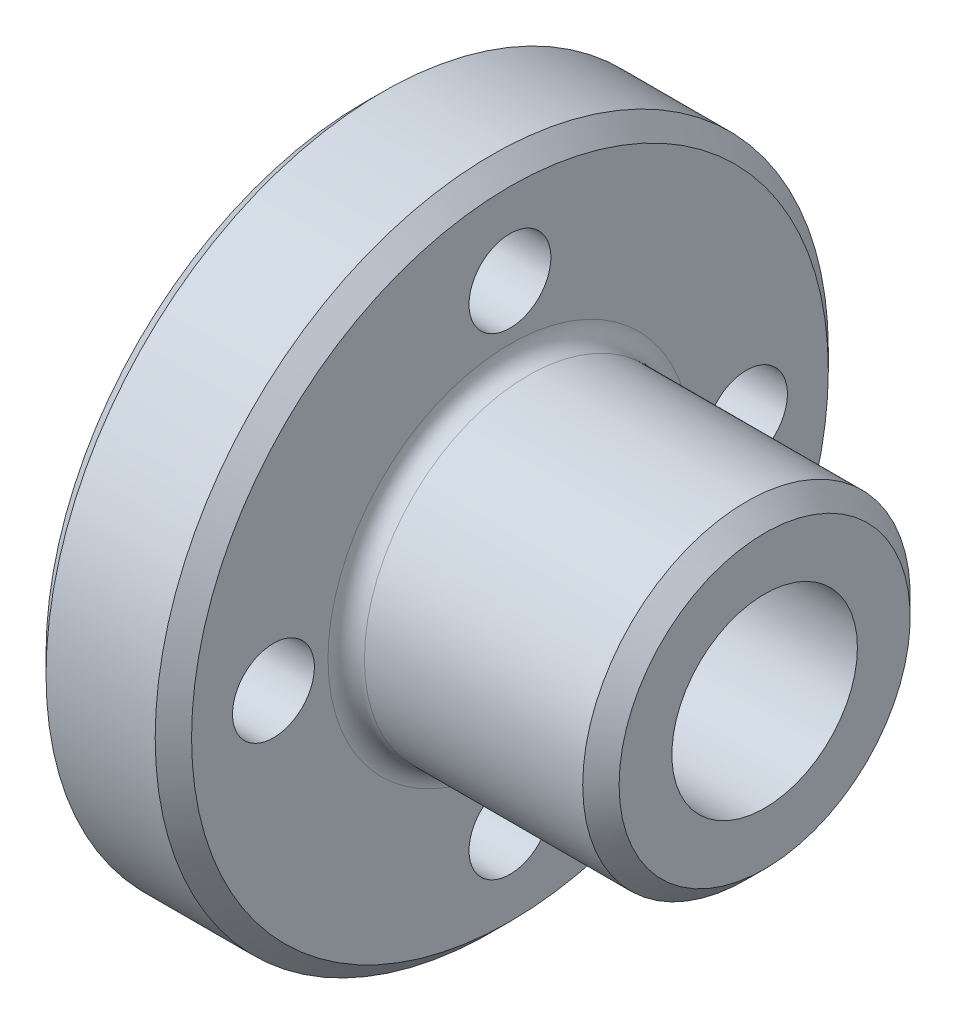
ISO-10303-21;
HEADER;
FILE_DESCRIPTION(('STEP AP214'),'2;1');
FILE_NAME('part.step','',(''),(''),'','','');
FILE_SCHEMA(('AUTOMOTIVE_DESIGN { 1 0 10303 214 1 1 1 1 }'));
ENDSEC;
DATA;
#1=APPLICATION_CONTEXT('core data for automotive mechanical design processes');
#2=APPLICATION_PROTOCOL_DEFINITION('international standard','automotive_design',2000,#1);
#3=PRODUCT_CONTEXT('',#1,'mechanical');
#4=PRODUCT('Part','Part','',(#3));
#5=PRODUCT_RELATED_PRODUCT_CATEGORY('part','',(#4));
#6=PRODUCT_DEFINITION_FORMATION('','',#4);
#7=PRODUCT_DEFINITION_CONTEXT('part definition',#1,'design');
#8=PRODUCT_DEFINITION('design','',#6,#7);
#9=PRODUCT_DEFINITION_SHAPE('','',#8);
#10=(LENGTH_UNIT() NAMED_UNIT(*) SI_UNIT(.MILLI.,.METRE.));
#11=(NAMED_UNIT(*) PLANE_ANGLE_UNIT() SI_UNIT($,.RADIAN.));
#12=(NAMED_UNIT(*) SI_UNIT($,.STERADIAN.) SOLID_ANGLE_UNIT());
#13=UNCERTAINTY_MEASURE_WITH_UNIT(LENGTH_MEASURE(1.E-05),#10,'distance_accuracy_value','');
#14=(GEOMETRIC_REPRESENTATION_CONTEXT(3) GLOBAL_UNCERTAINTY_ASSIGNED_CONTEXT((#13)) GLOBAL_UNIT_ASSIGNED_CONTEXT((#10,
#11,#12)) REPRESENTATION_CONTEXT('',''));
#15=CARTESIAN_POINT('',(0.,0.,0.));
#16=DIRECTION('',(0.,0.,1.));
#17=DIRECTION('',(1.,0.,0.));
#18=AXIS2_PLACEMENT_3D('',#15,#16,#17);
#19=CARTESIAN_POINT('',(0.,0.,0.));
#20=DIRECTION('',(1.,0.,0.));
#21=DIRECTION('',(0.,0.,-1.));
#22=AXIS2_PLACEMENT_3D('',#19,#20,#21);
#23=PLANE('',#22);
#24=CARTESIAN_POINT('',(0.,0.,0.));
#25=DIRECTION('',(1.,0.,0.));
#26=DIRECTION('',(0.,0.,-1.));
#27=AXIS2_PLACEMENT_3D('',#24,#25,#26);
#28=CIRCLE('',#27,6.10000000000001);
#29=CARTESIAN_POINT('',(0.,0.,-6.10000000000001));
#30=VERTEX_POINT('',#29);
#31=EDGE_CURVE('E39',#30,#30,#28,.T.);
#32=ORIENTED_EDGE('',*,*,#31,.T.);
#33=EDGE_LOOP('',(#32));
#34=FACE_BOUND('',#33,.T.);
#35=CARTESIAN_POINT('',(0.,0.,0.));
#36=DIRECTION('',(1.,0.,0.));
#37=DIRECTION('',(0.,0.,-1.));
#38=AXIS2_PLACEMENT_3D('',#35,#36,#37);
#39=CIRCLE('',#38,17.5);
#40=CARTESIAN_POINT('',(0.,0.,-17.5));
#41=VERTEX_POINT('',#40);
#42=EDGE_CURVE('E61',#41,#41,#39,.F.);
#43=ORIENTED_EDGE('',*,*,#42,.T.);
#44=EDGE_LOOP('',(#43));
#45=FACE_BOUND('',#44,.T.);
#46=CARTESIAN_POINT('',(0.,1.36167772214882E-13,13.));
#47=DIRECTION('',(-1.,0.,0.));
#48=DIRECTION('',(0.,0.,1.));
#49=AXIS2_PLACEMENT_3D('',#46,#47,#48);
#50=CIRCLE('',#49,4.);
#51=CARTESIAN_POINT('',(0.,1.36167772214882E-13,17.));
#52=VERTEX_POINT('',#51);
#53=EDGE_CURVE('E115',#52,#52,#50,.T.);
#54=ORIENTED_EDGE('',*,*,#53,.F.);
#55=EDGE_LOOP('',(#54));
#56=FACE_BOUND('',#55,.T.);
#57=CARTESIAN_POINT('',(0.,-13.,0.));
#58=DIRECTION('',(-1.,0.,0.));
#59=DIRECTION('',(0.,0.,1.));
#60=AXIS2_PLACEMENT_3D('',#57,#58,#59);
#61=CIRCLE('',#60,4.);
#62=CARTESIAN_POINT('',(0.,-13.,4.));
#63=VERTEX_POINT('',#62);
#64=EDGE_CURVE('E74',#63,#63,#61,.T.);
#65=ORIENTED_EDGE('',*,*,#64,.F.);
#66=EDGE_LOOP('',(#65));
#67=FACE_BOUND('',#66,.T.);
#68=CARTESIAN_POINT('',(0.,0.,-13.));
#69=DIRECTION('',(-1.,0.,0.));
#70=DIRECTION('',(0.,0.,1.));
#71=AXIS2_PLACEMENT_3D('',#68,#69,#70);
#72=CIRCLE('',#71,4.);
#73=CARTESIAN_POINT('',(0.,0.,-9.));
#74=VERTEX_POINT('',#73);
#75=EDGE_CURVE('E79',#74,#74,#72,.T.);
#76=ORIENTED_EDGE('',*,*,#75,.F.);
#77=EDGE_LOOP('',(#76));
#78=FACE_BOUND('',#77,.T.);
#79=CARTESIAN_POINT('',(0.,13.,0.));
#80=DIRECTION('',(-1.,0.,0.));
#81=DIRECTION('',(0.,0.,1.));
#82=AXIS2_PLACEMENT_3D('',#79,#80,#81);
#83=CIRCLE('',#82,4.);
#84=CARTESIAN_POINT('',(0.,13.,4.));
#85=VERTEX_POINT('',#84);
#86=EDGE_CURVE('E84',#85,#85,#83,.T.);
#87=ORIENTED_EDGE('',*,*,#86,.F.);
#88=EDGE_LOOP('',(#87));
#89=FACE_BOUND('',#88,.T.);
#90=ADVANCED_FACE('F32',(#34,#45,#56,#67,#78,#89),#23,.F.);
#91=CARTESIAN_POINT('',(22.,0.,0.));
#92=DIRECTION('',(-1.,0.,0.));
#93=DIRECTION('',(0.,0.,1.));
#94=AXIS2_PLACEMENT_3D('',#91,#92,#93);
#95=CYLINDRICAL_SURFACE('',#94,18.5);
#96=CARTESIAN_POINT('',(1.,0.,0.));
#97=DIRECTION('',(1.,0.,0.));
#98=DIRECTION('',(0.,0.,-1.));
#99=AXIS2_PLACEMENT_3D('',#96,#97,#98);
#100=CIRCLE('',#99,18.5);
#101=CARTESIAN_POINT('',(1.,0.,-18.5));
#102=VERTEX_POINT('',#101);
#103=EDGE_CURVE('E55',#102,#102,#100,.T.);
#104=ORIENTED_EDGE('',*,*,#103,.T.);
#105=EDGE_LOOP('',(#104));
#106=FACE_BOUND('',#105,.T.);
#107=CARTESIAN_POINT('',(6.99999999999999,0.,0.));
#108=DIRECTION('',(-1.,0.,0.));
#109=DIRECTION('',(0.,0.,1.));
#110=AXIS2_PLACEMENT_3D('',#107,#108,#109);
#111=CIRCLE('',#110,18.5);
#112=CARTESIAN_POINT('',(6.99999999999999,0.,18.5));
#113=VERTEX_POINT('',#112);
#114=EDGE_CURVE('E58',#113,#113,#111,.T.);
#115=ORIENTED_EDGE('',*,*,#114,.T.);
#116=EDGE_LOOP('',(#115));
#117=FACE_BOUND('',#116,.T.);
#118=ADVANCED_FACE('F154',(#106,#117),#95,.T.);
#119=CARTESIAN_POINT('',(8.,18.5,0.));
#120=DIRECTION('',(-1.,0.,0.));
#121=DIRECTION('',(0.,0.,1.));
#122=AXIS2_PLACEMENT_3D('',#119,#120,#121);
#123=PLANE('',#122);
#124=CARTESIAN_POINT('',(8.,0.,0.));
#125=DIRECTION('',(-1.,0.,0.));
#126=DIRECTION('',(0.,0.,1.));
#127=AXIS2_PLACEMENT_3D('',#124,#125,#126);
#128=CIRCLE('',#127,17.5);
#129=CARTESIAN_POINT('',(8.,0.,17.5));
#130=VERTEX_POINT('',#129);
#131=EDGE_CURVE('E52',#130,#130,#128,.F.);
#132=ORIENTED_EDGE('',*,*,#131,.T.);
#133=EDGE_LOOP('',(#132));
#134=FACE_BOUND('',#133,.T.);
#135=CARTESIAN_POINT('',(8.,0.,0.));
#136=DIRECTION('',(-1.,0.,0.));
#137=DIRECTION('',(0.,0.,1.));
#138=AXIS2_PLACEMENT_3D('',#135,#136,#137);
#139=CIRCLE('',#138,10.);
#140=CARTESIAN_POINT('',(8.,0.,10.));
#141=VERTEX_POINT('',#140);
#142=EDGE_CURVE('E67',#141,#141,#139,.T.);
#143=ORIENTED_EDGE('',*,*,#142,.T.);
#144=EDGE_LOOP('',(#143));
#145=FACE_BOUND('',#144,.T.);
#146=CARTESIAN_POINT('',(8.,1.36167772214882E-13,13.));
#147=DIRECTION('',(-1.,0.,0.));
#148=DIRECTION('',(0.,0.,1.));
#149=AXIS2_PLACEMENT_3D('',#146,#147,#148);
#150=CIRCLE('',#149,2.25);
#151=CARTESIAN_POINT('',(8.,1.36167772214882E-13,15.25));
#152=VERTEX_POINT('',#151);
#153=EDGE_CURVE('E71',#152,#152,#150,.T.);
#154=ORIENTED_EDGE('',*,*,#153,.T.);
#155=EDGE_LOOP('',(#154));
#156=FACE_BOUND('',#155,.T.);
#157=CARTESIAN_POINT('',(8.,-13.,0.));
#158=DIRECTION('',(-1.,0.,0.));
#159=DIRECTION('',(0.,0.,1.));
#160=AXIS2_PLACEMENT_3D('',#157,#158,#159);
#161=CIRCLE('',#160,2.25);
#162=CARTESIAN_POINT('',(8.,-13.,2.25));
#163=VERTEX_POINT('',#162);
#164=EDGE_CURVE('E76',#163,#163,#161,.T.);
#165=ORIENTED_EDGE('',*,*,#164,.T.);
#166=EDGE_LOOP('',(#165));
#167=FACE_BOUND('',#166,.T.);
#168=CARTESIAN_POINT('',(8.,0.,-13.));
#169=DIRECTION('',(-1.,0.,0.));
#170=DIRECTION('',(0.,0.,1.));
#171=AXIS2_PLACEMENT_3D('',#168,#169,#170);
#172=CIRCLE('',#171,2.25);
#173=CARTESIAN_POINT('',(8.,0.,-10.75));
#174=VERTEX_POINT('',#173);
#175=EDGE_CURVE('E81',#174,#174,#172,.T.);
#176=ORIENTED_EDGE('',*,*,#175,.T.);
#177=EDGE_LOOP('',(#176));
#178=FACE_BOUND('',#177,.T.);
#179=CARTESIAN_POINT('',(8.,13.,0.));
#180=DIRECTION('',(-1.,0.,0.));
#181=DIRECTION('',(0.,0.,1.));
#182=AXIS2_PLACEMENT_3D('',#179,#180,#181);
#183=CIRCLE('',#182,2.25);
#184=CARTESIAN_POINT('',(8.,13.,2.25));
#185=VERTEX_POINT('',#184);
#186=EDGE_CURVE('E70',#185,#185,#183,.T.);
#187=ORIENTED_EDGE('',*,*,#186,.T.);
#188=EDGE_LOOP('',(#187));
#189=FACE_BOUND('',#188,.T.);
#190=ADVANCED_FACE('F140',(#134,#145,#156,#167,#178,#189),#123,.F.);
#191=CARTESIAN_POINT('',(22.,0.,0.));
#192=DIRECTION('',(-1.,0.,0.));
#193=DIRECTION('',(0.,0.,1.));
#194=AXIS2_PLACEMENT_3D('',#191,#192,#193);
#195=CYLINDRICAL_SURFACE('',#194,9.);
#196=CARTESIAN_POINT('',(21.,0.,0.));
#197=DIRECTION('',(-1.,0.,0.));
#198=DIRECTION('',(0.,0.,1.));
#199=AXIS2_PLACEMENT_3D('',#196,#197,#198);
#200=CIRCLE('',#199,9.);
#201=CARTESIAN_POINT('',(21.,0.,9.));
#202=VERTEX_POINT('',#201);
#203=EDGE_CURVE('E47',#202,#202,#200,.T.);
#204=ORIENTED_EDGE('',*,*,#203,.T.);
#205=EDGE_LOOP('',(#204));
#206=FACE_BOUND('',#205,.T.);
#207=CARTESIAN_POINT('',(9.,0.,0.));
#208=DIRECTION('',(-1.,0.,0.));
#209=DIRECTION('',(0.,0.,1.));
#210=AXIS2_PLACEMENT_3D('',#207,#208,#209);
#211=CIRCLE('',#210,9.);
#212=CARTESIAN_POINT('',(9.,0.,9.));
#213=VERTEX_POINT('',#212);
#214=EDGE_CURVE('E64',#213,#213,#211,.F.);
#215=ORIENTED_EDGE('',*,*,#214,.T.);
#216=EDGE_LOOP('',(#215));
#217=FACE_BOUND('',#216,.T.);
#218=ADVANCED_FACE('F128',(#206,#217),#195,.T.);
#219=CARTESIAN_POINT('',(22.,9.,0.));
#220=DIRECTION('',(-1.,0.,0.));
#221=DIRECTION('',(0.,0.,1.));
#222=AXIS2_PLACEMENT_3D('',#219,#220,#221);
#223=PLANE('',#222);
#224=CARTESIAN_POINT('',(22.,0.,0.));
#225=DIRECTION('',(1.,0.,0.));
#226=DIRECTION('',(0.,0.,-1.));
#227=AXIS2_PLACEMENT_3D('',#224,#225,#226);
#228=CIRCLE('',#227,5.1);
#229=CARTESIAN_POINT('',(22.,0.,-5.1));
#230=VERTEX_POINT('',#229);
#231=EDGE_CURVE('E118',#230,#230,#228,.T.);
#232=ORIENTED_EDGE('',*,*,#231,.F.);
#233=EDGE_LOOP('',(#232));
#234=FACE_BOUND('',#233,.T.);
#235=CARTESIAN_POINT('',(22.,0.,0.));
#236=DIRECTION('',(-1.,0.,0.));
#237=DIRECTION('',(0.,0.,1.));
#238=AXIS2_PLACEMENT_3D('',#235,#236,#237);
#239=CIRCLE('',#238,7.99999999999999);
#240=CARTESIAN_POINT('',(22.,0.,7.99999999999999));
#241=VERTEX_POINT('',#240);
#242=EDGE_CURVE('E43',#241,#241,#239,.F.);
#243=ORIENTED_EDGE('',*,*,#242,.T.);
#244=EDGE_LOOP('',(#243));
#245=FACE_BOUND('',#244,.T.);
#246=ADVANCED_FACE('F124',(#234,#245),#223,.F.);
#247=CARTESIAN_POINT('',(0.,13.,0.));
#248=DIRECTION('',(-1.,0.,0.));
#249=DIRECTION('',(0.,0.,1.));
#250=AXIS2_PLACEMENT_3D('',#247,#248,#249);
#251=CYLINDRICAL_SURFACE('',#250,2.25);
#252=CARTESIAN_POINT('',(2.6,13.,0.));
#253=DIRECTION('',(-1.,0.,0.));
#254=DIRECTION('',(0.,0.,1.));
#255=AXIS2_PLACEMENT_3D('',#252,#253,#254);
#256=CIRCLE('',#255,2.25);
#257=CARTESIAN_POINT('',(2.6,13.,2.25));
#258=VERTEX_POINT('',#257);
#259=EDGE_CURVE('E88',#258,#258,#256,.T.);
#260=ORIENTED_EDGE('',*,*,#259,.T.);
#261=EDGE_LOOP('',(#260));
#262=FACE_BOUND('',#261,.T.);
#263=ORIENTED_EDGE('',*,*,#186,.F.);
#264=EDGE_LOOP('',(#263));
#265=FACE_BOUND('',#264,.T.);
#266=ADVANCED_FACE('F127',(#262,#265),#251,.F.);
#267=CARTESIAN_POINT('',(2.6,15.25,0.));
#268=DIRECTION('',(1.,0.,0.));
#269=DIRECTION('',(0.,0.,-1.));
#270=AXIS2_PLACEMENT_3D('',#267,#268,#269);
#271=PLANE('',#270);
#272=ORIENTED_EDGE('',*,*,#259,.F.);
#273=EDGE_LOOP('',(#272));
#274=FACE_BOUND('',#273,.T.);
#275=CARTESIAN_POINT('',(2.6,13.,0.));
#276=DIRECTION('',(-1.,0.,0.));
#277=DIRECTION('',(0.,0.,1.));
#278=AXIS2_PLACEMENT_3D('',#275,#276,#277);
#279=CIRCLE('',#278,4.);
#280=CARTESIAN_POINT('',(2.6,13.,4.));
#281=VERTEX_POINT('',#280);
#282=EDGE_CURVE('E91',#281,#281,#279,.T.);
#283=ORIENTED_EDGE('',*,*,#282,.T.);
#284=EDGE_LOOP('',(#283));
#285=FACE_BOUND('',#284,.T.);
#286=ADVANCED_FACE('F166',(#274,#285),#271,.F.);
#287=CARTESIAN_POINT('',(0.,13.,0.));
#288=DIRECTION('',(-1.,0.,0.));
#289=DIRECTION('',(0.,0.,1.));
#290=AXIS2_PLACEMENT_3D('',#287,#288,#289);
#291=CYLINDRICAL_SURFACE('',#290,4.);
#292=ORIENTED_EDGE('',*,*,#282,.F.);
#293=EDGE_LOOP('',(#292));
#294=FACE_BOUND('',#293,.T.);
#295=ORIENTED_EDGE('',*,*,#86,.T.);
#296=EDGE_LOOP('',(#295));
#297=FACE_BOUND('',#296,.T.);
#298=ADVANCED_FACE('F172',(#294,#297),#291,.F.);
#299=CARTESIAN_POINT('',(0.,0.,-13.));
#300=DIRECTION('',(-1.,0.,0.));
#301=DIRECTION('',(0.,0.,1.));
#302=AXIS2_PLACEMENT_3D('',#299,#300,#301);
#303=CYLINDRICAL_SURFACE('',#302,2.25);
#304=CARTESIAN_POINT('',(2.6,0.,-13.));
#305=DIRECTION('',(-1.,0.,0.));
#306=DIRECTION('',(0.,0.,1.));
#307=AXIS2_PLACEMENT_3D('',#304,#305,#306);
#308=CIRCLE('',#307,2.25);
#309=CARTESIAN_POINT('',(2.6,0.,-10.75));
#310=VERTEX_POINT('',#309);
#311=EDGE_CURVE('E85',#310,#310,#308,.T.);
#312=ORIENTED_EDGE('',*,*,#311,.T.);
#313=EDGE_LOOP('',(#312));
#314=FACE_BOUND('',#313,.T.);
#315=ORIENTED_EDGE('',*,*,#175,.F.);
#316=EDGE_LOOP('',(#315));
#317=FACE_BOUND('',#316,.T.);
#318=ADVANCED_FACE('F328',(#314,#317),#303,.F.);
#319=CARTESIAN_POINT('',(2.6,2.24999999999996,-13.));
#320=DIRECTION('',(1.,0.,0.));
#321=DIRECTION('',(0.,0.,-1.));
#322=AXIS2_PLACEMENT_3D('',#319,#320,#321);
#323=PLANE('',#322);
#324=ORIENTED_EDGE('',*,*,#311,.F.);
#325=EDGE_LOOP('',(#324));
#326=FACE_BOUND('',#325,.T.);
#327=CARTESIAN_POINT('',(2.6,0.,-13.));
#328=DIRECTION('',(-1.,0.,0.));
#329=DIRECTION('',(0.,0.,1.));
#330=AXIS2_PLACEMENT_3D('',#327,#328,#329);
#331=CIRCLE('',#330,4.);
#332=CARTESIAN_POINT('',(2.6,0.,-9.));
#333=VERTEX_POINT('',#332);
#334=EDGE_CURVE('E98',#333,#333,#331,.T.);
#335=ORIENTED_EDGE('',*,*,#334,.T.);
#336=EDGE_LOOP('',(#335));
#337=FACE_BOUND('',#336,.T.);
#338=ADVANCED_FACE('F318',(#326,#337),#323,.F.);
#339=CARTESIAN_POINT('',(0.,0.,-13.));
#340=DIRECTION('',(-1.,0.,0.));
#341=DIRECTION('',(0.,0.,1.));
#342=AXIS2_PLACEMENT_3D('',#339,#340,#341);
#343=CYLINDRICAL_SURFACE('',#342,4.);
#344=ORIENTED_EDGE('',*,*,#334,.F.);
#345=EDGE_LOOP('',(#344));
#346=FACE_BOUND('',#345,.T.);
#347=ORIENTED_EDGE('',*,*,#75,.T.);
#348=EDGE_LOOP('',(#347));
#349=FACE_BOUND('',#348,.T.);
#350=ADVANCED_FACE('F308',(#346,#349),#343,.F.);
#351=CARTESIAN_POINT('',(0.,-13.,0.));
#352=DIRECTION('',(-1.,0.,0.));
#353=DIRECTION('',(0.,0.,1.));
#354=AXIS2_PLACEMENT_3D('',#351,#352,#353);
#355=CYLINDRICAL_SURFACE('',#354,2.25);
#356=CARTESIAN_POINT('',(2.6,-13.,0.));
#357=DIRECTION('',(-1.,0.,0.));
#358=DIRECTION('',(0.,0.,1.));
#359=AXIS2_PLACEMENT_3D('',#356,#357,#358);
#360=CIRCLE('',#359,2.25);
#361=CARTESIAN_POINT('',(2.6,-13.,2.25));
#362=VERTEX_POINT('',#361);
#363=EDGE_CURVE('E80',#362,#362,#360,.T.);
#364=ORIENTED_EDGE('',*,*,#363,.T.);
#365=EDGE_LOOP('',(#364));
#366=FACE_BOUND('',#365,.T.);
#367=ORIENTED_EDGE('',*,*,#164,.F.);
#368=EDGE_LOOP('',(#367));
#369=FACE_BOUND('',#368,.T.);
#370=ADVANCED_FACE('F298',(#366,#369),#355,.F.);
#371=CARTESIAN_POINT('',(2.6,-10.75,0.));
#372=DIRECTION('',(1.,0.,0.));
#373=DIRECTION('',(0.,0.,-1.));
#374=AXIS2_PLACEMENT_3D('',#371,#372,#373);
#375=PLANE('',#374);
#376=ORIENTED_EDGE('',*,*,#363,.F.);
#377=EDGE_LOOP('',(#376));
#378=FACE_BOUND('',#377,.T.);
#379=CARTESIAN_POINT('',(2.6,-13.,0.));
#380=DIRECTION('',(-1.,0.,0.));
#381=DIRECTION('',(0.,0.,1.));
#382=AXIS2_PLACEMENT_3D('',#379,#380,#381);
#383=CIRCLE('',#382,4.);
#384=CARTESIAN_POINT('',(2.6,-13.,4.));
#385=VERTEX_POINT('',#384);
#386=EDGE_CURVE('E105',#385,#385,#383,.T.);
#387=ORIENTED_EDGE('',*,*,#386,.T.);
#388=EDGE_LOOP('',(#387));
#389=FACE_BOUND('',#388,.T.);
#390=ADVANCED_FACE('F288',(#378,#389),#375,.F.);
#391=CARTESIAN_POINT('',(0.,-13.,0.));
#392=DIRECTION('',(-1.,0.,0.));
#393=DIRECTION('',(0.,0.,1.));
#394=AXIS2_PLACEMENT_3D('',#391,#392,#393);
#395=CYLINDRICAL_SURFACE('',#394,4.);
#396=ORIENTED_EDGE('',*,*,#386,.F.);
#397=EDGE_LOOP('',(#396));
#398=FACE_BOUND('',#397,.T.);
#399=ORIENTED_EDGE('',*,*,#64,.T.);
#400=EDGE_LOOP('',(#399));
#401=FACE_BOUND('',#400,.T.);
#402=ADVANCED_FACE('F278',(#398,#401),#395,.F.);
#403=CARTESIAN_POINT('',(0.,1.36167772214882E-13,13.));
#404=DIRECTION('',(-1.,0.,0.));
#405=DIRECTION('',(0.,0.,1.));
#406=AXIS2_PLACEMENT_3D('',#403,#404,#405);
#407=CYLINDRICAL_SURFACE('',#406,2.25);
#408=CARTESIAN_POINT('',(2.6,1.36167772214882E-13,13.));
#409=DIRECTION('',(-1.,0.,0.));
#410=DIRECTION('',(0.,0.,1.));
#411=AXIS2_PLACEMENT_3D('',#408,#409,#410);
#412=CIRCLE('',#411,2.25);
#413=CARTESIAN_POINT('',(2.6,1.36167772214882E-13,15.25));
#414=VERTEX_POINT('',#413);
#415=EDGE_CURVE('E75',#414,#414,#412,.T.);
#416=ORIENTED_EDGE('',*,*,#415,.T.);
#417=EDGE_LOOP('',(#416));
#418=FACE_BOUND('',#417,.T.);
#419=ORIENTED_EDGE('',*,*,#153,.F.);
#420=EDGE_LOOP('',(#419));
#421=FACE_BOUND('',#420,.T.);
#422=ADVANCED_FACE('F268',(#418,#421),#407,.F.);
#423=CARTESIAN_POINT('',(2.6,2.25000000000014,13.));
#424=DIRECTION('',(1.,0.,0.));
#425=DIRECTION('',(0.,0.,-1.));
#426=AXIS2_PLACEMENT_3D('',#423,#424,#425);
#427=PLANE('',#426);
#428=ORIENTED_EDGE('',*,*,#415,.F.);
#429=EDGE_LOOP('',(#428));
#430=FACE_BOUND('',#429,.T.);
#431=CARTESIAN_POINT('',(2.6,1.36167772214882E-13,13.));
#432=DIRECTION('',(-1.,0.,0.));
#433=DIRECTION('',(0.,0.,1.));
#434=AXIS2_PLACEMENT_3D('',#431,#432,#433);
#435=CIRCLE('',#434,4.);
#436=CARTESIAN_POINT('',(2.6,1.36167772214882E-13,17.));
#437=VERTEX_POINT('',#436);
#438=EDGE_CURVE('E112',#437,#437,#435,.T.);
#439=ORIENTED_EDGE('',*,*,#438,.T.);
#440=EDGE_LOOP('',(#439));
#441=FACE_BOUND('',#440,.T.);
#442=ADVANCED_FACE('F258',(#430,#441),#427,.F.);
#443=CARTESIAN_POINT('',(0.,1.36167772214882E-13,13.));
#444=DIRECTION('',(-1.,0.,0.));
#445=DIRECTION('',(0.,0.,1.));
#446=AXIS2_PLACEMENT_3D('',#443,#444,#445);
#447=CYLINDRICAL_SURFACE('',#446,4.);
#448=ORIENTED_EDGE('',*,*,#438,.F.);
#449=EDGE_LOOP('',(#448));
#450=FACE_BOUND('',#449,.T.);
#451=ORIENTED_EDGE('',*,*,#53,.T.);
#452=EDGE_LOOP('',(#451));
#453=FACE_BOUND('',#452,.T.);
#454=ADVANCED_FACE('F148',(#450,#453),#447,.F.);
#455=CARTESIAN_POINT('',(9.,0.,0.));
#456=DIRECTION('',(-1.,0.,0.));
#457=DIRECTION('',(0.,0.,1.));
#458=AXIS2_PLACEMENT_3D('',#455,#456,#457);
#459=TOROIDAL_SURFACE('',#458,10.,1.);
#460=ORIENTED_EDGE('',*,*,#214,.F.);
#461=EDGE_LOOP('',(#460));
#462=FACE_BOUND('',#461,.T.);
#463=ORIENTED_EDGE('',*,*,#142,.F.);
#464=EDGE_LOOP('',(#463));
#465=FACE_BOUND('',#464,.T.);
#466=ADVANCED_FACE('F144',(#462,#465),#459,.F.);
#467=CARTESIAN_POINT('',(0.,0.,0.));
#468=DIRECTION('',(1.,0.,0.));
#469=DIRECTION('',(0.,0.,-1.));
#470=AXIS2_PLACEMENT_3D('',#467,#468,#469);
#471=CONICAL_SURFACE('',#470,17.5,0.785398163397452);
#472=ORIENTED_EDGE('',*,*,#103,.F.);
#473=EDGE_LOOP('',(#472));
#474=FACE_BOUND('',#473,.T.);
#475=ORIENTED_EDGE('',*,*,#42,.F.);
#476=EDGE_LOOP('',(#475));
#477=FACE_BOUND('',#476,.T.);
#478=ADVANCED_FACE('F147',(#474,#477),#471,.T.);
#479=CARTESIAN_POINT('',(6.99999999999999,0.,0.));
#480=DIRECTION('',(-1.,0.,0.));
#481=DIRECTION('',(0.,0.,1.));
#482=AXIS2_PLACEMENT_3D('',#479,#480,#481);
#483=CONICAL_SURFACE('',#482,18.5,0.785398163397452);
#484=ORIENTED_EDGE('',*,*,#131,.F.);
#485=EDGE_LOOP('',(#484));
#486=FACE_BOUND('',#485,.T.);
#487=ORIENTED_EDGE('',*,*,#114,.F.);
#488=EDGE_LOOP('',(#487));
#489=FACE_BOUND('',#488,.T.);
#490=ADVANCED_FACE('F135',(#486,#489),#483,.T.);
#491=CARTESIAN_POINT('',(21.,0.,0.));
#492=DIRECTION('',(-1.,0.,0.));
#493=DIRECTION('',(0.,0.,1.));
#494=AXIS2_PLACEMENT_3D('',#491,#492,#493);
#495=CONICAL_SURFACE('',#494,9.,0.78539816339745);
#496=ORIENTED_EDGE('',*,*,#242,.F.);
#497=EDGE_LOOP('',(#496));
#498=FACE_BOUND('',#497,.T.);
#499=ORIENTED_EDGE('',*,*,#203,.F.);
#500=EDGE_LOOP('',(#499));
#501=FACE_BOUND('',#500,.T.);
#502=ADVANCED_FACE('F132',(#498,#501),#495,.T.);
#503=CARTESIAN_POINT('',(22.,0.,0.));
#504=DIRECTION('',(1.,0.,0.));
#505=DIRECTION('',(0.,0.,-1.));
#506=AXIS2_PLACEMENT_3D('',#503,#504,#505);
#507=CYLINDRICAL_SURFACE('',#506,5.09999999999999);
#508=CARTESIAN_POINT('',(1.00000000000001,0.,0.));
#509=DIRECTION('',(1.,0.,0.));
#510=DIRECTION('',(0.,0.,-1.));
#511=AXIS2_PLACEMENT_3D('',#508,#509,#510);
#512=CIRCLE('',#511,5.09999999999999);
#513=CARTESIAN_POINT('',(1.00000000000001,0.,-5.09999999999999));
#514=VERTEX_POINT('',#513);
#515=EDGE_CURVE('E10',#514,#514,#512,.F.);
#516=ORIENTED_EDGE('',*,*,#515,.T.);
#517=EDGE_LOOP('',(#516));
#518=FACE_BOUND('',#517,.T.);
#519=ORIENTED_EDGE('',*,*,#231,.T.);
#520=EDGE_LOOP('',(#519));
#521=FACE_BOUND('',#520,.T.);
#522=ADVANCED_FACE('F122',(#518,#521),#507,.F.);
#523=CARTESIAN_POINT('',(0.,0.,0.));
#524=DIRECTION('',(-1.,0.,0.));
#525=DIRECTION('',(0.,0.,1.));
#526=AXIS2_PLACEMENT_3D('',#523,#524,#525);
#527=CONICAL_SURFACE('',#526,6.10000000000001,0.78539816339745);
#528=ORIENTED_EDGE('',*,*,#515,.F.);
#529=EDGE_LOOP('',(#528));
#530=FACE_BOUND('',#529,.T.);
#531=ORIENTED_EDGE('',*,*,#31,.F.);
#532=EDGE_LOOP('',(#531));
#533=FACE_BOUND('',#532,.T.);
#534=ADVANCED_FACE('F34',(#530,#533),#527,.F.);
#535=CLOSED_SHELL('',(#90,#118,#190,#218,#246,#266,#286,#298,#318,#338,#350,#370,#390,#402,#422,
#442,#454,#466,#478,#490,#502,#522,#534));
#536=MANIFOLD_SOLID_BREP('B2',#535);
#537=ADVANCED_BREP_SHAPE_REPRESENTATION('',(#18,#536),#14);
#538=SHAPE_DEFINITION_REPRESENTATION(#9,#537);
ENDSEC;
END-ISO-10303-21;
